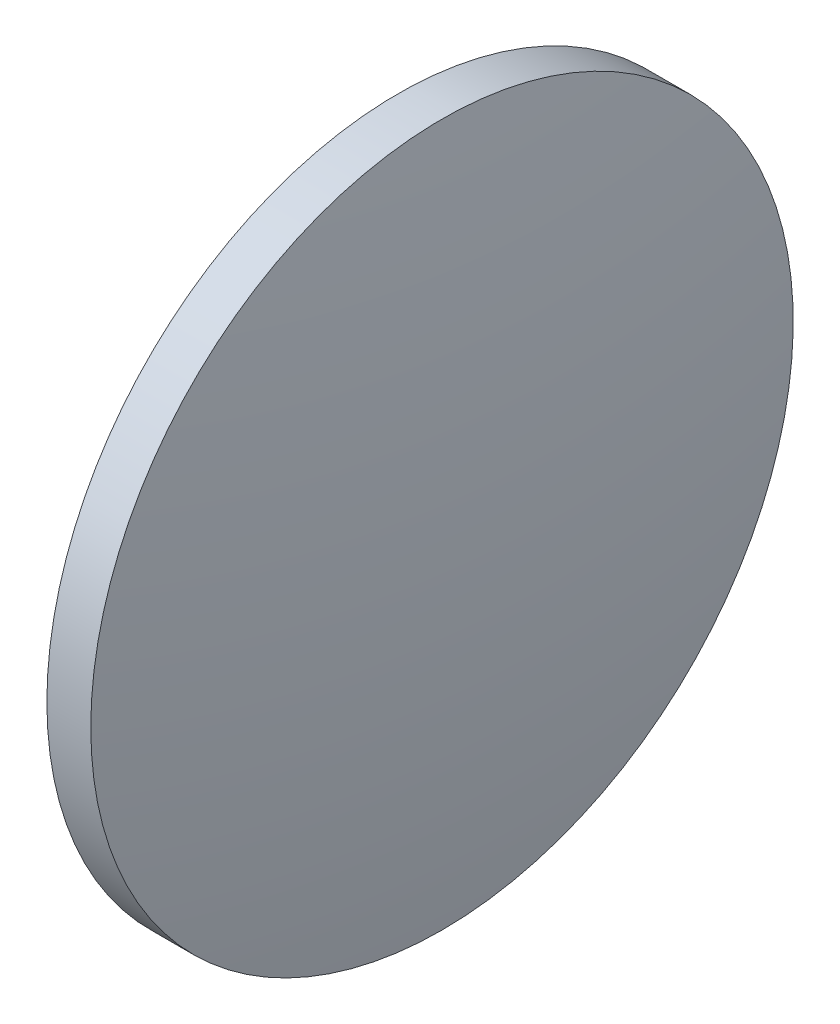
ISO-10303-21;
HEADER;
FILE_DESCRIPTION(('STEP AP214'),'2;1');
FILE_NAME('part.step','',(''),(''),'','','');
FILE_SCHEMA(('AUTOMOTIVE_DESIGN { 1 0 10303 214 1 1 1 1 }'));
ENDSEC;
DATA;
#1=APPLICATION_CONTEXT('core data for automotive mechanical design processes');
#2=APPLICATION_PROTOCOL_DEFINITION('international standard','automotive_design',2000,#1);
#3=PRODUCT_CONTEXT('',#1,'mechanical');
#4=PRODUCT('Part','Part','',(#3));
#5=PRODUCT_RELATED_PRODUCT_CATEGORY('part','',(#4));
#6=PRODUCT_DEFINITION_FORMATION('','',#4);
#7=PRODUCT_DEFINITION_CONTEXT('part definition',#1,'design');
#8=PRODUCT_DEFINITION('design','',#6,#7);
#9=PRODUCT_DEFINITION_SHAPE('','',#8);
#10=(LENGTH_UNIT() NAMED_UNIT(*) SI_UNIT(.MILLI.,.METRE.));
#11=(NAMED_UNIT(*) PLANE_ANGLE_UNIT() SI_UNIT($,.RADIAN.));
#12=(NAMED_UNIT(*) SI_UNIT($,.STERADIAN.) SOLID_ANGLE_UNIT());
#13=UNCERTAINTY_MEASURE_WITH_UNIT(LENGTH_MEASURE(1.E-05),#10,'distance_accuracy_value','');
#14=(GEOMETRIC_REPRESENTATION_CONTEXT(3) GLOBAL_UNCERTAINTY_ASSIGNED_CONTEXT((#13)) GLOBAL_UNIT_ASSIGNED_CONTEXT((#10,
#11,#12)) REPRESENTATION_CONTEXT('',''));
#15=CARTESIAN_POINT('',(0.,0.,0.));
#16=DIRECTION('',(0.,0.,1.));
#17=DIRECTION('',(1.,0.,0.));
#18=AXIS2_PLACEMENT_3D('',#15,#16,#17);
#19=CARTESIAN_POINT('',(325.02283191923,48.3400402005195,0.));
#20=DIRECTION('',(-1.,0.,0.));
#21=DIRECTION('',(0.,-1.,0.));
#22=AXIS2_PLACEMENT_3D('',#19,#20,#21);
#23=SPHERICAL_SURFACE('',#22,128.985128205128);
#24=CARTESIAN_POINT('',(452.447960124358,48.3400402005194,0.));
#25=DIRECTION('',(-1.,0.,0.));
#26=DIRECTION('',(0.,0.,1.));
#27=AXIS2_PLACEMENT_3D('',#24,#25,#26);
#28=CIRCLE('',#27,20.);
#29=CARTESIAN_POINT('',(452.447960124358,48.3400402005194,20.));
#30=VERTEX_POINT('',#29);
#31=EDGE_CURVE('E10',#30,#30,#28,.T.);
#32=ORIENTED_EDGE('',*,*,#31,.F.);
#33=EDGE_LOOP('',(#32));
#34=FACE_BOUND('',#33,.T.);
#35=ADVANCED_FACE('F35',(#34),#23,.T.);
#36=CARTESIAN_POINT('',(445.253416943781,48.3400402005194,0.));
#37=DIRECTION('',(-1.,0.,0.));
#38=DIRECTION('',(0.,0.,1.));
#39=AXIS2_PLACEMENT_3D('',#36,#37,#38);
#40=CYLINDRICAL_SURFACE('',#39,20.);
#41=CARTESIAN_POINT('',(449.947960124358,48.3400402005194,0.));
#42=DIRECTION('',(-1.,0.,0.));
#43=DIRECTION('',(0.,0.,1.));
#44=AXIS2_PLACEMENT_3D('',#41,#42,#43);
#45=CIRCLE('',#44,20.);
#46=CARTESIAN_POINT('',(449.947960124358,48.3400402005194,20.));
#47=VERTEX_POINT('',#46);
#48=EDGE_CURVE('E41',#47,#47,#45,.T.);
#49=ORIENTED_EDGE('',*,*,#48,.F.);
#50=EDGE_LOOP('',(#49));
#51=FACE_BOUND('',#50,.T.);
#52=ORIENTED_EDGE('',*,*,#31,.T.);
#53=EDGE_LOOP('',(#52));
#54=FACE_BOUND('',#53,.T.);
#55=ADVANCED_FACE('F49',(#51,#54),#40,.T.);
#56=CARTESIAN_POINT('',(449.947960124358,48.3400402005194,0.));
#57=DIRECTION('',(1.,0.,0.));
#58=DIRECTION('',(0.,0.,-1.));
#59=AXIS2_PLACEMENT_3D('',#56,#57,#58);
#60=PLANE('',#59);
#61=ORIENTED_EDGE('',*,*,#48,.T.);
#62=EDGE_LOOP('',(#61));
#63=FACE_BOUND('',#62,.T.);
#64=ADVANCED_FACE('F47',(#63),#60,.F.);
#65=CLOSED_SHELL('',(#35,#55,#64));
#66=MANIFOLD_SOLID_BREP('B2',#65);
#67=ADVANCED_BREP_SHAPE_REPRESENTATION('',(#18,#66),#14);
#68=SHAPE_DEFINITION_REPRESENTATION(#9,#67);
ENDSEC;
END-ISO-10303-21;
